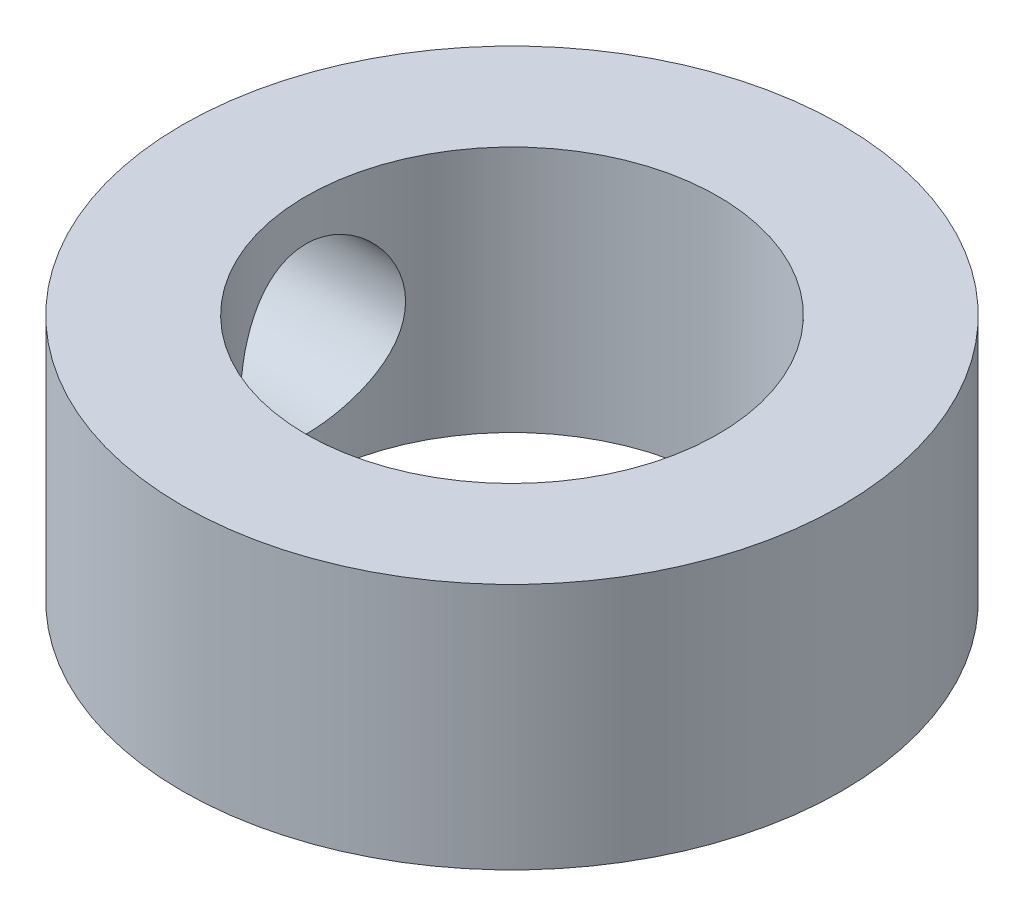
ISO-10303-21;
HEADER;
FILE_DESCRIPTION(('STEP AP214'),'2;1');
FILE_NAME('part.step','',(''),(''),'','','');
FILE_SCHEMA(('AUTOMOTIVE_DESIGN { 1 0 10303 214 1 1 1 1 }'));
ENDSEC;
DATA;
#1=APPLICATION_CONTEXT('core data for automotive mechanical design processes');
#2=APPLICATION_PROTOCOL_DEFINITION('international standard','automotive_design',2000,#1);
#3=PRODUCT_CONTEXT('',#1,'mechanical');
#4=PRODUCT('Part','Part','',(#3));
#5=PRODUCT_RELATED_PRODUCT_CATEGORY('part','',(#4));
#6=PRODUCT_DEFINITION_FORMATION('','',#4);
#7=PRODUCT_DEFINITION_CONTEXT('part definition',#1,'design');
#8=PRODUCT_DEFINITION('design','',#6,#7);
#9=PRODUCT_DEFINITION_SHAPE('','',#8);
#10=(LENGTH_UNIT() NAMED_UNIT(*) SI_UNIT(.MILLI.,.METRE.));
#11=(NAMED_UNIT(*) PLANE_ANGLE_UNIT() SI_UNIT($,.RADIAN.));
#12=(NAMED_UNIT(*) SI_UNIT($,.STERADIAN.) SOLID_ANGLE_UNIT());
#13=UNCERTAINTY_MEASURE_WITH_UNIT(LENGTH_MEASURE(1.E-05),#10,'distance_accuracy_value','');
#14=(GEOMETRIC_REPRESENTATION_CONTEXT(3) GLOBAL_UNCERTAINTY_ASSIGNED_CONTEXT((#13)) GLOBAL_UNIT_ASSIGNED_CONTEXT((#10,
#11,#12)) REPRESENTATION_CONTEXT('',''));
#15=CARTESIAN_POINT('',(0.,0.,0.));
#16=DIRECTION('',(0.,0.,1.));
#17=DIRECTION('',(1.,0.,0.));
#18=AXIS2_PLACEMENT_3D('',#15,#16,#17);
#19=CARTESIAN_POINT('',(0.,3.,0.));
#20=DIRECTION('',(0.,1.,0.));
#21=DIRECTION('',(0.,0.,1.));
#22=AXIS2_PLACEMENT_3D('',#19,#20,#21);
#23=PLANE('',#22);
#24=CARTESIAN_POINT('',(0.,3.,0.));
#25=DIRECTION('',(0.,1.,0.));
#26=DIRECTION('',(0.,0.,1.));
#27=AXIS2_PLACEMENT_3D('',#24,#25,#26);
#28=CIRCLE('',#27,4.);
#29=CARTESIAN_POINT('',(0.,3.,4.));
#30=VERTEX_POINT('',#29);
#31=EDGE_CURVE('E10',#30,#30,#28,.T.);
#32=ORIENTED_EDGE('',*,*,#31,.T.);
#33=EDGE_LOOP('',(#32));
#34=FACE_BOUND('',#33,.T.);
#35=CARTESIAN_POINT('',(0.,3.,0.));
#36=DIRECTION('',(0.,1.,0.));
#37=DIRECTION('',(0.,0.,1.));
#38=AXIS2_PLACEMENT_3D('',#35,#36,#37);
#39=CIRCLE('',#38,2.5);
#40=CARTESIAN_POINT('',(0.,3.,2.5));
#41=VERTEX_POINT('',#40);
#42=EDGE_CURVE('E49',#41,#41,#39,.T.);
#43=ORIENTED_EDGE('',*,*,#42,.F.);
#44=EDGE_LOOP('',(#43));
#45=FACE_BOUND('',#44,.T.);
#46=ADVANCED_FACE('F31',(#34,#45),#23,.T.);
#47=CARTESIAN_POINT('',(0.,0.,0.));
#48=DIRECTION('',(0.,1.,0.));
#49=DIRECTION('',(0.,0.,1.));
#50=AXIS2_PLACEMENT_3D('',#47,#48,#49);
#51=PLANE('',#50);
#52=CARTESIAN_POINT('',(0.,0.,0.));
#53=DIRECTION('',(0.,1.,0.));
#54=DIRECTION('',(0.,0.,1.));
#55=AXIS2_PLACEMENT_3D('',#52,#53,#54);
#56=CIRCLE('',#55,4.);
#57=CARTESIAN_POINT('',(0.,0.,4.));
#58=VERTEX_POINT('',#57);
#59=EDGE_CURVE('E44',#58,#58,#56,.T.);
#60=ORIENTED_EDGE('',*,*,#59,.F.);
#61=EDGE_LOOP('',(#60));
#62=FACE_BOUND('',#61,.T.);
#63=CARTESIAN_POINT('',(0.,0.,0.));
#64=DIRECTION('',(0.,1.,0.));
#65=DIRECTION('',(0.,0.,1.));
#66=AXIS2_PLACEMENT_3D('',#63,#64,#65);
#67=CIRCLE('',#66,2.5);
#68=CARTESIAN_POINT('',(0.,0.,2.5));
#69=VERTEX_POINT('',#68);
#70=EDGE_CURVE('E51',#69,#69,#67,.T.);
#71=ORIENTED_EDGE('',*,*,#70,.T.);
#72=EDGE_LOOP('',(#71));
#73=FACE_BOUND('',#72,.T.);
#74=ADVANCED_FACE('F71',(#62,#73),#51,.F.);
#75=CARTESIAN_POINT('',(0.,3.,0.));
#76=DIRECTION('',(0.,-1.,0.));
#77=DIRECTION('',(0.,0.,-1.));
#78=AXIS2_PLACEMENT_3D('',#75,#76,#77);
#79=CYLINDRICAL_SURFACE('',#78,4.);
#80=CARTESIAN_POINT('',(-3.87298334620742,1.5,-1.));
#81=CARTESIAN_POINT('',(-3.87298440057185,1.55522030035679,-0.999998431438699));
#82=CARTESIAN_POINT('',(-3.87417722499278,1.61045795943136,-0.995410498208069));
#83=CARTESIAN_POINT('',(-3.87880744892249,1.71934703123261,-0.977209250194446));
#84=CARTESIAN_POINT('',(-3.8822461547418,1.77299750177996,-0.963590682698077));
#85=CARTESIAN_POINT('',(-3.89095489813012,1.87712141528784,-0.927796479849635));
#86=CARTESIAN_POINT('',(-3.8962225706936,1.92759886215776,-0.905631891140944));
#87=CARTESIAN_POINT('',(-3.90799276818327,2.02412434101248,-0.853408456505407));
#88=CARTESIAN_POINT('',(-3.91449534553241,2.07017218483115,-0.823349275424505));
#89=CARTESIAN_POINT('',(-3.92816286540368,2.15754465810584,-0.755483370924518));
#90=CARTESIAN_POINT('',(-3.93533839048709,2.19875744014028,-0.717534755081557));
#91=CARTESIAN_POINT('',(-3.94945150206622,2.27430455774388,-0.635272825640328));
#92=CARTESIAN_POINT('',(-3.95638906626691,2.30863825024863,-0.59095891767214));
#93=CARTESIAN_POINT('',(-3.96936166208095,2.36991018705258,-0.496458080431564));
#94=CARTESIAN_POINT('',(-3.975382749602,2.3967385552646,-0.446197830478043));
#95=CARTESIAN_POINT('',(-3.9857232477043,2.44152385766121,-0.341705273717109));
#96=CARTESIAN_POINT('',(-3.99004290933747,2.4594821007662,-0.287473554316777));
#97=CARTESIAN_POINT('',(-3.99641903539262,2.48565913383144,-0.177743503501663));
#98=CARTESIAN_POINT('',(-3.99851957537723,2.49406785773063,-0.12229308781959));
#99=CARTESIAN_POINT('',(-4.00037437642922,2.50150335171022,-0.0107315277051078));
#100=CARTESIAN_POINT('',(-4.00012898438682,2.50053150888384,0.0453795178152276));
#101=CARTESIAN_POINT('',(-3.99735237981413,2.48937005989994,0.155352247172388));
#102=CARTESIAN_POINT('',(-3.99487200936349,2.47938546997846,0.209236215601067));
#103=CARTESIAN_POINT('',(-3.98796334609942,2.4508114919806,0.314538247413686));
#104=CARTESIAN_POINT('',(-3.98353494959376,2.43222164584904,0.365956179370438));
#105=CARTESIAN_POINT('',(-3.97315003880358,2.38679897172517,0.465406703501806));
#106=CARTESIAN_POINT('',(-3.96718007878021,2.3598931821353,0.513404509766504));
#107=CARTESIAN_POINT('',(-3.9543596152386,2.2986577283535,0.604275622340488));
#108=CARTESIAN_POINT('',(-3.94750895860996,2.26432677257575,0.647148035085505));
#109=CARTESIAN_POINT('',(-3.93345485507808,2.18811650320705,0.727774035084956));
#110=CARTESIAN_POINT('',(-3.92624687810367,2.14605804306089,0.765357679075199));
#111=CARTESIAN_POINT('',(-3.91246017406683,2.0561600105839,0.832976375963018));
#112=CARTESIAN_POINT('',(-3.90588147642388,2.0083201682036,0.863011076046016));
#113=CARTESIAN_POINT('',(-3.89408198732659,1.90788398634041,0.914788129022598));
#114=CARTESIAN_POINT('',(-3.88886793490288,1.85526570787472,0.936489566970491));
#115=CARTESIAN_POINT('',(-3.88047456055983,1.74696581276942,0.970685620636341));
#116=CARTESIAN_POINT('',(-3.87729480324087,1.69128485440675,0.98318220655291));
#117=CARTESIAN_POINT('',(-3.87342142415656,1.58001619939075,0.998331855466071));
#118=CARTESIAN_POINT('',(-3.87266435637459,1.52446488266815,1.00123618956785));
#119=CARTESIAN_POINT('',(-3.87354937392416,1.41367122536874,0.997806796206219));
#120=CARTESIAN_POINT('',(-3.87519123840506,1.3584288568195,0.99147391913952));
#121=CARTESIAN_POINT('',(-3.88062832781824,1.25075429401812,0.969970185575065));
#122=CARTESIAN_POINT('',(-3.8843878809375,1.19829090937166,0.954945627312698));
#123=CARTESIAN_POINT('',(-3.89360287308385,1.09662741685933,0.916647232668248));
#124=CARTESIAN_POINT('',(-3.89905851299445,1.04742769637786,0.893372419085018));
#125=CARTESIAN_POINT('',(-3.91118454837305,0.95262348885306,0.838708267174623));
#126=CARTESIAN_POINT('',(-3.91787667442657,0.907108463982759,0.807168701534251));
#127=CARTESIAN_POINT('',(-3.93166833228686,0.821924654879459,0.737060292934456));
#128=CARTESIAN_POINT('',(-3.93876793091388,0.78225683333997,0.698490294805439));
#129=CARTESIAN_POINT('',(-3.95278961212643,0.708875582971617,0.614262720984726));
#130=CARTESIAN_POINT('',(-3.95970280824734,0.675335974980475,0.568451952531592));
#131=CARTESIAN_POINT('',(-3.97238886645494,0.616425653219503,0.471702682694675));
#132=CARTESIAN_POINT('',(-3.97816178801584,0.591054513356718,0.420764448957591));
#133=CARTESIAN_POINT('',(-3.98788046295326,0.549421586188828,0.31555820173109));
#134=CARTESIAN_POINT('',(-3.99183932008964,0.533094286248376,0.261317381027882));
#135=CARTESIAN_POINT('',(-3.99754117358315,0.509815866156633,0.150749760318808));
#136=CARTESIAN_POINT('',(-3.99928459757363,0.50286293650438,0.094423365041244));
#137=CARTESIAN_POINT('',(-4.00034169408811,0.498632410424466,-0.0170835264433259));
#138=CARTESIAN_POINT('',(-3.99971978880008,0.50109829090461,-0.0722538269660326));
#139=CARTESIAN_POINT('',(-3.99625896457423,0.515047827294332,-0.181367496414739));
#140=CARTESIAN_POINT('',(-3.99342011157094,0.526531215013103,-0.235310901780886));
#141=CARTESIAN_POINT('',(-3.98585432853963,0.558052219770927,-0.340171035644816));
#142=CARTESIAN_POINT('',(-3.98113764502669,0.578043453314624,-0.391102494581019));
#143=CARTESIAN_POINT('',(-3.97031288913382,0.625970579019327,-0.488917053041468));
#144=CARTESIAN_POINT('',(-3.96420464137727,0.653907472669569,-0.53579964126505));
#145=CARTESIAN_POINT('',(-3.95107249681342,0.71771523399707,-0.6254019284239));
#146=CARTESIAN_POINT('',(-3.94403016945646,0.753760142907367,-0.667994988300587));
#147=CARTESIAN_POINT('',(-3.92990649053207,0.832422851973808,-0.746615020271251));
#148=CARTESIAN_POINT('',(-3.92282512952424,0.875042316097944,-0.782640325068177));
#149=CARTESIAN_POINT('',(-3.90927475860683,0.966601414201293,-0.847762026479239));
#150=CARTESIAN_POINT('',(-3.90281963730391,1.01564412341248,-0.876716619446592));
#151=CARTESIAN_POINT('',(-3.8914395555011,1.11805548992285,-0.925926896615621));
#152=CARTESIAN_POINT('',(-3.88651348244814,1.17142096610729,-0.946188909759556));
#153=CARTESIAN_POINT('',(-3.87951908741315,1.27057701182627,-0.974422528565571));
#154=CARTESIAN_POINT('',(-3.87708663005761,1.31589316438236,-0.983993170595829));
#155=CARTESIAN_POINT('',(-3.87381838580358,1.40746886900147,-0.996782292572819));
#156=CARTESIAN_POINT('',(-3.87298246270639,1.45372834025063,-1.00000131437052));
#157=CARTESIAN_POINT('',(-3.87298334620742,1.5,-1.));
#158=B_SPLINE_CURVE_WITH_KNOTS('',3,(#80,#81,#82,#83,#84,#85,#86,#87,#88,#89,#90,#91,#92,#93,
#94,#95,#96,#97,#98,#99,#100,#101,#102,#103,#104,#105,#106,#107,#108,#109,#110,#111,#112,#113,
#114,#115,#116,#117,#118,#119,#120,#121,#122,#123,#124,#125,#126,#127,#128,#129,#130,#131,#132,
#133,#134,#135,#136,#137,#138,#139,#140,#141,#142,#143,#144,#145,#146,#147,#148,#149,#150,#151,
#152,#153,#154,#155,#156,#157),.UNSPECIFIED.,.T.,.F.,(4,2,2,2,2,2,2,2,2,2,2,2,2,2,2,2,2,2,2,2,2,
2,2,2,2,2,2,2,2,2,2,2,2,2,2,2,2,2,4),(0.,0.16549097667523,0.331078296534211,0.496452290829152,
0.661833306984658,0.830495816734649,0.999174085882211,1.17020598555442,1.34121263935111,
1.50875500394413,1.67627259462683,1.84007305071853,2.00388222686189,2.16917149698052,
2.3344895418384,2.50428186625039,2.67408212476195,2.84470572799635,3.01529280048093,
3.18137429900961,3.34744050869795,3.51078961999957,3.67415808564841,3.84073138339937,
4.00733207550292,4.17810132382402,4.34886166284096,4.51836829119046,4.6878421955989,
4.85273378447257,5.01762046947067,5.18161950620159,5.34563922291503,5.51358838629103,
5.68158012622478,5.85270590910145,6.02370688542922,6.16239130867207,6.30106390036083),.UNSPECIFIED.);
#159=CARTESIAN_POINT('',(-3.87298334620742,1.5,-1.));
#160=VERTEX_POINT('',#159);
#161=EDGE_CURVE('E54',#160,#160,#158,.T.);
#162=ORIENTED_EDGE('',*,*,#161,.T.);
#163=EDGE_LOOP('',(#162));
#164=FACE_BOUND('',#163,.T.);
#165=ORIENTED_EDGE('',*,*,#31,.F.);
#166=EDGE_LOOP('',(#165));
#167=FACE_BOUND('',#166,.T.);
#168=ORIENTED_EDGE('',*,*,#59,.T.);
#169=EDGE_LOOP('',(#168));
#170=FACE_BOUND('',#169,.T.);
#171=ADVANCED_FACE('F33',(#164,#167,#170),#79,.T.);
#172=CARTESIAN_POINT('',(0.,3.,0.));
#173=DIRECTION('',(0.,-1.,0.));
#174=DIRECTION('',(0.,0.,-1.));
#175=AXIS2_PLACEMENT_3D('',#172,#173,#174);
#176=CYLINDRICAL_SURFACE('',#175,2.5);
#177=CARTESIAN_POINT('',(-2.29128784747792,1.5,-1.));
#178=CARTESIAN_POINT('',(-2.29129325828211,1.55356974904995,-0.999994127101894));
#179=CARTESIAN_POINT('',(-2.29319301242133,1.60721526735235,-0.995669909297176));
#180=CARTESIAN_POINT('',(-2.30055457093922,1.71296741643853,-0.978534515296365));
#181=CARTESIAN_POINT('',(-2.30602547693426,1.76506975854024,-0.965701652221065));
#182=CARTESIAN_POINT('',(-2.31980227895648,1.86602647098503,-0.932117516284352));
#183=CARTESIAN_POINT('',(-2.32809748178558,1.91489227368013,-0.911396076262712));
#184=CARTESIAN_POINT('',(-2.3465733254764,2.00844252542981,-0.862710134685805));
#185=CARTESIAN_POINT('',(-2.35675355451962,2.05312788457543,-0.834747214633749));
#186=CARTESIAN_POINT('',(-2.37850432525516,2.13963020112073,-0.770660987293709));
#187=CARTESIAN_POINT('',(-2.39011958979373,2.18117821146473,-0.734189678863663));
#188=CARTESIAN_POINT('',(-2.41306228489406,2.25776449865769,-0.654854552887022));
#189=CARTESIAN_POINT('',(-2.42438961368186,2.29280050064493,-0.61198851083784));
#190=CARTESIAN_POINT('',(-2.44601703953427,2.35670319849135,-0.519003155178189));
#191=CARTESIAN_POINT('',(-2.45625901841784,2.38527215073532,-0.46866448280614));
#192=CARTESIAN_POINT('',(-2.47401963815773,2.4334217841949,-0.363412661437559));
#193=CARTESIAN_POINT('',(-2.48153938692337,2.45300612289098,-0.308501384643981));
#194=CARTESIAN_POINT('',(-2.49269162504143,2.4816707432187,-0.198483213419446));
#195=CARTESIAN_POINT('',(-2.49649468387679,2.49121365704451,-0.143514492402303));
#196=CARTESIAN_POINT('',(-2.50040155341352,2.50101424283135,-0.0326331643188254));
#197=CARTESIAN_POINT('',(-2.50050674384656,2.50127537796742,0.0232790829127015));
#198=CARTESIAN_POINT('',(-2.49710981410893,2.49275861511251,0.131116247357656));
#199=CARTESIAN_POINT('',(-2.49380998385918,2.48448761362653,0.183088726437017));
#200=CARTESIAN_POINT('',(-2.48424645734395,2.46000356184462,0.284836554609169));
#201=CARTESIAN_POINT('',(-2.47798254360556,2.4437899287998,0.334611742195079));
#202=CARTESIAN_POINT('',(-2.4629841222885,2.40368175856185,0.431448969255828));
#203=CARTESIAN_POINT('',(-2.454213802334,2.37967514259223,0.478458811689817));
#204=CARTESIAN_POINT('',(-2.43507292589849,2.32476749654049,0.567904075370287));
#205=CARTESIAN_POINT('',(-2.42470182132537,2.29386410345119,0.610337921358054));
#206=CARTESIAN_POINT('',(-2.40260818589167,2.2236754320267,0.692384413996075));
#207=CARTESIAN_POINT('',(-2.3908416326012,2.18397305370808,0.731628922636821));
#208=CARTESIAN_POINT('',(-2.36780830482389,2.09850471408952,0.803053707692662));
#209=CARTESIAN_POINT('',(-2.35654169488174,2.05273677592292,0.835231671879828));
#210=CARTESIAN_POINT('',(-2.33548448720906,1.95479048879553,0.892452094371465));
#211=CARTESIAN_POINT('',(-2.32574457090691,1.90246758475809,0.917267325867452));
#212=CARTESIAN_POINT('',(-2.30943795233662,1.79389225476899,0.957588129983133));
#213=CARTESIAN_POINT('',(-2.3028691896167,1.73764240761458,0.973099749202199));
#214=CARTESIAN_POINT('',(-2.29414879836282,1.62648211128198,0.993477474415979));
#215=CARTESIAN_POINT('',(-2.29175183224038,1.57169977643992,0.998936048404205));
#216=CARTESIAN_POINT('',(-2.29094748938549,1.46196139611603,1.00078066322451));
#217=CARTESIAN_POINT('',(-2.29253890281232,1.40700540836108,0.997169455296441));
#218=CARTESIAN_POINT('',(-2.29928022178566,1.30177053252256,0.981516447394262));
#219=CARTESIAN_POINT('',(-2.30422228898885,1.25140353130025,0.969966531011728));
#220=CARTESIAN_POINT('',(-2.31685025513936,1.153355797607,0.939402093455638));
#221=CARTESIAN_POINT('',(-2.32453676244372,1.10567566344634,0.920385917151196));
#222=CARTESIAN_POINT('',(-2.34216890929975,1.01219882110226,0.874567819740726));
#223=CARTESIAN_POINT('',(-2.35219352319568,0.966556905652772,0.847481434132297));
#224=CARTESIAN_POINT('',(-2.37325192578919,0.880258506279167,0.786582612220937));
#225=CARTESIAN_POINT('',(-2.38428612448031,0.839604063602202,0.752767436740991));
#226=CARTESIAN_POINT('',(-2.40710457985699,0.761313295700394,0.676422105840241));
#227=CARTESIAN_POINT('',(-2.41888403642601,0.724121717354485,0.633432714722549));
#228=CARTESIAN_POINT('',(-2.44109897283782,0.657411461694831,0.541541816684422));
#229=CARTESIAN_POINT('',(-2.4515343979662,0.627893096701383,0.492640069233931));
#230=CARTESIAN_POINT('',(-2.46991857950143,0.577476186769387,0.39013996700088));
#231=CARTESIAN_POINT('',(-2.47786793120137,0.556575577917107,0.336542740497032));
#232=CARTESIAN_POINT('',(-2.49036356734645,0.524225573796185,0.226196795459612));
#233=CARTESIAN_POINT('',(-2.49491169853772,0.512771049279967,0.169449805147134));
#234=CARTESIAN_POINT('',(-2.49989504105256,0.500247649187307,0.0584082551731509));
#235=CARTESIAN_POINT('',(-2.50057923372437,0.498549935768675,0.00419524629652692));
#236=CARTESIAN_POINT('',(-2.49843021189296,0.503927739642053,-0.103716917866622));
#237=CARTESIAN_POINT('',(-2.49559752983456,0.51100192889281,-0.157416149697311));
#238=CARTESIAN_POINT('',(-2.48685756682127,0.53327339417924,-0.261085450973206));
#239=CARTESIAN_POINT('',(-2.48104740317165,0.548214473037778,-0.311119402324193));
#240=CARTESIAN_POINT('',(-2.46697473916019,0.585526402280912,-0.40796117737947));
#241=CARTESIAN_POINT('',(-2.45871178652006,0.607898623010173,-0.454768404133638));
#242=CARTESIAN_POINT('',(-2.44009047180029,0.660551599244671,-0.546101520928057));
#243=CARTESIAN_POINT('',(-2.42965564864115,0.691138147442541,-0.590435193403212));
#244=CARTESIAN_POINT('',(-2.40794701593224,0.758894259589467,-0.673527014262036));
#245=CARTESIAN_POINT('',(-2.3966728602525,0.796066548230058,-0.712282842872877));
#246=CARTESIAN_POINT('',(-2.37368881779711,0.878657612262524,-0.785600632542995));
#247=CARTESIAN_POINT('',(-2.36199516302692,0.924444436700553,-0.819754443599514));
#248=CARTESIAN_POINT('',(-2.3402483573759,1.02147106871438,-0.879923725219698));
#249=CARTESIAN_POINT('',(-2.33019539943728,1.07271151645493,-0.905938238949994));
#250=CARTESIAN_POINT('',(-2.31379432228954,1.17451860092403,-0.946995543836655));
#251=CARTESIAN_POINT('',(-2.30719459305824,1.22473261737559,-0.962813757082103));
#252=CARTESIAN_POINT('',(-2.29723001801982,1.32724270981517,-0.986358878909192));
#253=CARTESIAN_POINT('',(-2.29385616036088,1.37953255798348,-0.994108333944007));
#254=CARTESIAN_POINT('',(-2.29162229378817,1.45468878116896,-0.999232129155086));
#255=CARTESIAN_POINT('',(-2.29128555846679,1.4773376104988,-1.00000248449744));
#256=CARTESIAN_POINT('',(-2.29128784747792,1.5,-1.));
#257=B_SPLINE_CURVE_WITH_KNOTS('',3,(#177,#178,#179,#180,#181,#182,#183,#184,#185,#186,#187,
#188,#189,#190,#191,#192,#193,#194,#195,#196,#197,#198,#199,#200,#201,#202,#203,#204,#205,#206,
#207,#208,#209,#210,#211,#212,#213,#214,#215,#216,#217,#218,#219,#220,#221,#222,#223,#224,#225,
#226,#227,#228,#229,#230,#231,#232,#233,#234,#235,#236,#237,#238,#239,#240,#241,#242,#243,#244,
#245,#246,#247,#248,#249,#250,#251,#252,#253,#254,#255,#256),.UNSPECIFIED.,.T.,.F.,(4,2,2,2,2,2,
2,2,2,2,2,2,2,2,2,2,2,2,2,2,2,2,2,2,2,2,2,2,2,2,2,2,2,2,2,2,2,2,2,4),(0.,0.160638824383827,
0.321688667911123,0.482135411646696,0.642547144119308,0.811278091422124,0.980067871741712,
1.15551334545714,1.3308873348474,1.49777091443592,1.66459222652836,1.82204322415151,
1.9795057756453,2.13934150117449,2.29923207470016,2.46962022040678,2.64006403563563,
2.81532229357288,2.99046652397056,3.15491073759215,3.31930507450975,3.47433624039577,
3.62940179322824,3.79075577323355,3.9521755725993,4.12551867120495,4.29886882423379,
4.47217743653411,4.64539187974073,4.80730519874981,4.96919400753306,5.12610997218681,
5.28305488911298,5.44693525566967,5.61088358279108,5.78498126639812,5.95909940876599,
6.11758330406543,6.27562315106627,6.34358052760367),.UNSPECIFIED.);
#258=CARTESIAN_POINT('',(-2.29128784747792,1.5,-1.));
#259=VERTEX_POINT('',#258);
#260=EDGE_CURVE('E36',#259,#259,#257,.T.);
#261=ORIENTED_EDGE('',*,*,#260,.F.);
#262=EDGE_LOOP('',(#261));
#263=FACE_BOUND('',#262,.T.);
#264=ORIENTED_EDGE('',*,*,#42,.T.);
#265=EDGE_LOOP('',(#264));
#266=FACE_BOUND('',#265,.T.);
#267=ORIENTED_EDGE('',*,*,#70,.F.);
#268=EDGE_LOOP('',(#267));
#269=FACE_BOUND('',#268,.T.);
#270=ADVANCED_FACE('F63',(#263,#266,#269),#176,.F.);
#271=CARTESIAN_POINT('',(-13.,1.5,0.));
#272=DIRECTION('',(1.,0.,0.));
#273=DIRECTION('',(0.,0.,-1.));
#274=AXIS2_PLACEMENT_3D('',#271,#272,#273);
#275=CYLINDRICAL_SURFACE('',#274,1.);
#276=ORIENTED_EDGE('',*,*,#260,.T.);
#277=EDGE_LOOP('',(#276));
#278=FACE_BOUND('',#277,.T.);
#279=ORIENTED_EDGE('',*,*,#161,.F.);
#280=EDGE_LOOP('',(#279));
#281=FACE_BOUND('',#280,.T.);
#282=ADVANCED_FACE('F60',(#278,#281),#275,.F.);
#283=CLOSED_SHELL('',(#46,#74,#171,#270,#282));
#284=MANIFOLD_SOLID_BREP('B2',#283);
#285=ADVANCED_BREP_SHAPE_REPRESENTATION('',(#18,#284),#14);
#286=SHAPE_DEFINITION_REPRESENTATION(#9,#285);
ENDSEC;
END-ISO-10303-21;
